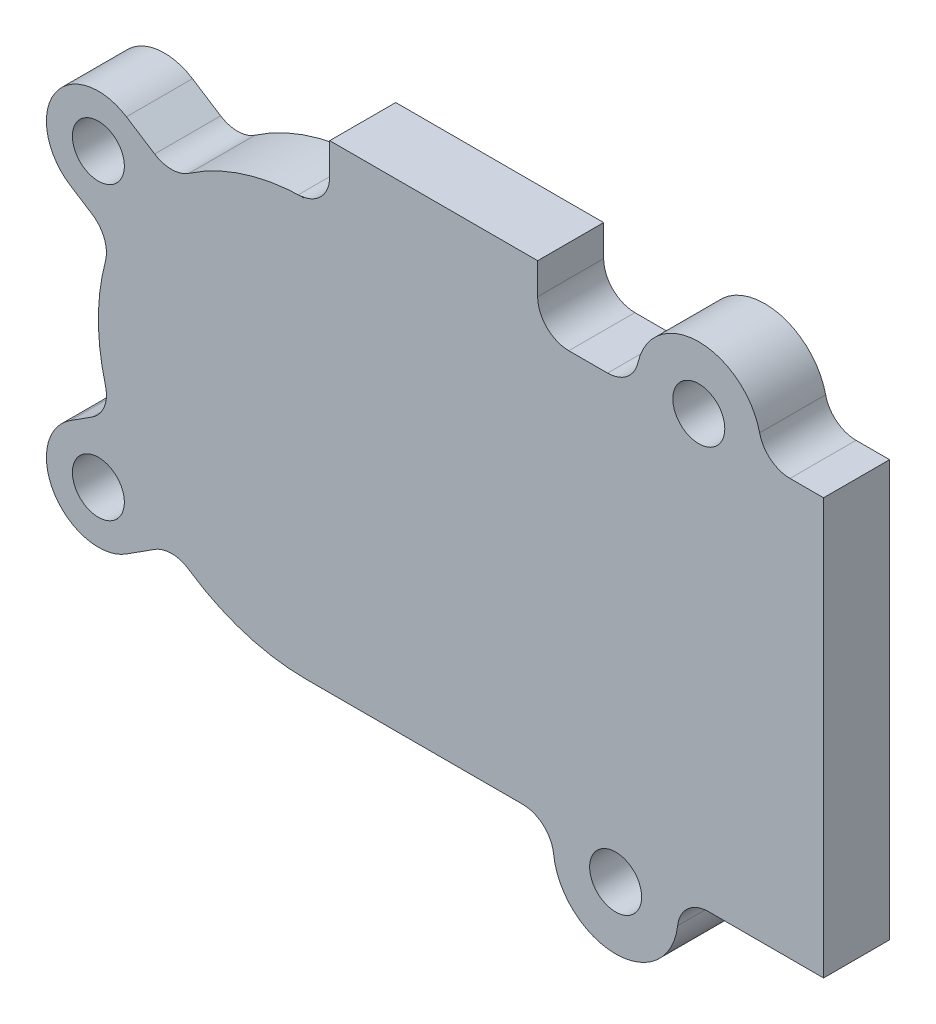
ISO-10303-21;
HEADER;
FILE_DESCRIPTION(('STEP AP214'),'2;1');
FILE_NAME('part.step','',(''),(''),'','','');
FILE_SCHEMA(('AUTOMOTIVE_DESIGN { 1 0 10303 214 1 1 1 1 }'));
ENDSEC;
DATA;
#1=APPLICATION_CONTEXT('core data for automotive mechanical design processes');
#2=APPLICATION_PROTOCOL_DEFINITION('international standard','automotive_design',2000,#1);
#3=PRODUCT_CONTEXT('',#1,'mechanical');
#4=PRODUCT('Part','Part','',(#3));
#5=PRODUCT_RELATED_PRODUCT_CATEGORY('part','',(#4));
#6=PRODUCT_DEFINITION_FORMATION('','',#4);
#7=PRODUCT_DEFINITION_CONTEXT('part definition',#1,'design');
#8=PRODUCT_DEFINITION('design','',#6,#7);
#9=PRODUCT_DEFINITION_SHAPE('','',#8);
#10=(LENGTH_UNIT() NAMED_UNIT(*) SI_UNIT(.MILLI.,.METRE.));
#11=(NAMED_UNIT(*) PLANE_ANGLE_UNIT() SI_UNIT($,.RADIAN.));
#12=(NAMED_UNIT(*) SI_UNIT($,.STERADIAN.) SOLID_ANGLE_UNIT());
#13=UNCERTAINTY_MEASURE_WITH_UNIT(LENGTH_MEASURE(1.E-05),#10,'distance_accuracy_value','');
#14=(GEOMETRIC_REPRESENTATION_CONTEXT(3) GLOBAL_UNCERTAINTY_ASSIGNED_CONTEXT((#13)) GLOBAL_UNIT_ASSIGNED_CONTEXT((#10,
#11,#12)) REPRESENTATION_CONTEXT('',''));
#15=CARTESIAN_POINT('',(0.,0.,0.));
#16=DIRECTION('',(0.,0.,1.));
#17=DIRECTION('',(1.,0.,0.));
#18=AXIS2_PLACEMENT_3D('',#15,#16,#17);
#19=CARTESIAN_POINT('',(17.5,-22.,6.35));
#20=DIRECTION('',(0.,0.,1.));
#21=DIRECTION('',(1.,0.,0.));
#22=AXIS2_PLACEMENT_3D('',#19,#20,#21);
#23=PLANE('',#22);
#24=CARTESIAN_POINT('',(-32.25,-14.,6.35));
#25=DIRECTION('',(0.,0.,1.));
#26=DIRECTION('',(1.,0.,0.));
#27=AXIS2_PLACEMENT_3D('',#24,#25,#26);
#28=CIRCLE('',#27,2.5);
#29=CARTESIAN_POINT('',(-29.75,-14.,6.35));
#30=VERTEX_POINT('',#29);
#31=EDGE_CURVE('E453',#30,#30,#28,.F.);
#32=ORIENTED_EDGE('',*,*,#31,.T.);
#33=EDGE_LOOP('',(#32));
#34=FACE_BOUND('',#33,.T.);
#35=DIRECTION('',(-0.841581546035128,-0.540130078197024,0.));
#36=VECTOR('',#35,1.);
#37=CARTESIAN_POINT('',(-0.344091690530346,0.536132366227416,6.35));
#38=LINE('',#37,#36);
#39=CARTESIAN_POINT('',(-26.8405061162537,-16.4693621852291,6.35));
#40=VERTEX_POINT('',#39);
#41=CARTESIAN_POINT('',(-29.5493496090149,-18.2079077301756,6.35));
#42=VERTEX_POINT('',#41);
#43=EDGE_CURVE('E408',#40,#42,#38,.T.);
#44=ORIENTED_EDGE('',*,*,#43,.F.);
#45=CARTESIAN_POINT('',(-25.2201158816627,-18.9941068233345,6.35));
#46=DIRECTION('',(0.,0.,1.));
#47=DIRECTION('',(1.,0.,0.));
#48=AXIS2_PLACEMENT_3D('',#45,#46,#47);
#49=CIRCLE('',#48,3.);
#50=CARTESIAN_POINT('',(-23.5283616362284,-16.5166146289865,6.35));
#51=VERTEX_POINT('',#50);
#52=EDGE_CURVE('E612',#40,#51,#49,.F.);
#53=ORIENTED_EDGE('',*,*,#52,.T.);
#54=CARTESIAN_POINT('',(-12.25,0.,6.35));
#55=DIRECTION('',(0.,0.,1.));
#56=DIRECTION('',(1.,0.,0.));
#57=AXIS2_PLACEMENT_3D('',#54,#55,#56);
#58=CIRCLE('',#57,20.);
#59=CARTESIAN_POINT('',(-12.25,-20.,6.35));
#60=VERTEX_POINT('',#59);
#61=EDGE_CURVE('E555',#51,#60,#58,.T.);
#62=ORIENTED_EDGE('',*,*,#61,.T.);
#63=DIRECTION('',(1.,0.,0.));
#64=VECTOR('',#63,1.);
#65=CARTESIAN_POINT('',(-37.5,-20.,6.35));
#66=LINE('',#65,#64);
#67=CARTESIAN_POINT('',(8.55572809000083,-20.,6.35));
#68=VERTEX_POINT('',#67);
#69=EDGE_CURVE('E498',#60,#68,#66,.T.);
#70=ORIENTED_EDGE('',*,*,#69,.T.);
#71=CARTESIAN_POINT('',(8.55572809000083,-23.,6.35));
#72=DIRECTION('',(0.,0.,1.));
#73=DIRECTION('',(1.,0.,0.));
#74=AXIS2_PLACEMENT_3D('',#71,#72,#73);
#75=CIRCLE('',#74,3.);
#76=CARTESIAN_POINT('',(11.5371520600005,-22.6666666666667,6.35));
#77=VERTEX_POINT('',#76);
#78=EDGE_CURVE('E629',#68,#77,#75,.F.);
#79=ORIENTED_EDGE('',*,*,#78,.T.);
#80=CARTESIAN_POINT('',(17.5,-22.,6.35));
#81=DIRECTION('',(0.,0.,1.));
#82=DIRECTION('',(1.,0.,0.));
#83=AXIS2_PLACEMENT_3D('',#80,#81,#82);
#84=CIRCLE('',#83,6.);
#85=CARTESIAN_POINT('',(23.4628479399994,-22.6666666666667,6.35));
#86=VERTEX_POINT('',#85);
#87=EDGE_CURVE('E501',#77,#86,#84,.T.);
#88=ORIENTED_EDGE('',*,*,#87,.T.);
#89=CARTESIAN_POINT('',(26.4442719099992,-23.,6.35));
#90=DIRECTION('',(0.,0.,1.));
#91=DIRECTION('',(1.,0.,0.));
#92=AXIS2_PLACEMENT_3D('',#89,#90,#91);
#93=CIRCLE('',#92,3.);
#94=CARTESIAN_POINT('',(26.4442719099992,-20.,6.35));
#95=VERTEX_POINT('',#94);
#96=EDGE_CURVE('E633',#86,#95,#93,.F.);
#97=ORIENTED_EDGE('',*,*,#96,.T.);
#98=DIRECTION('',(1.,0.,0.));
#99=VECTOR('',#98,1.);
#100=CARTESIAN_POINT('',(23.5,-20.,6.35));
#101=LINE('',#100,#99);
#102=CARTESIAN_POINT('',(37.5,-20.,6.35));
#103=VERTEX_POINT('',#102);
#104=EDGE_CURVE('E504',#95,#103,#101,.T.);
#105=ORIENTED_EDGE('',*,*,#104,.T.);
#106=DIRECTION('',(0.,1.,0.));
#107=VECTOR('',#106,1.);
#108=CARTESIAN_POINT('',(37.5,-20.,6.35));
#109=LINE('',#108,#107);
#110=CARTESIAN_POINT('',(37.5,20.,6.35));
#111=VERTEX_POINT('',#110);
#112=EDGE_CURVE('E506',#103,#111,#109,.T.);
#113=ORIENTED_EDGE('',*,*,#112,.T.);
#114=DIRECTION('',(-1.,0.,0.));
#115=VECTOR('',#114,1.);
#116=CARTESIAN_POINT('',(31.5,20.,6.35));
#117=LINE('',#116,#115);
#118=CARTESIAN_POINT('',(34.2749643873921,20.,6.35));
#119=VERTEX_POINT('',#118);
#120=EDGE_CURVE('E490',#111,#119,#117,.T.);
#121=ORIENTED_EDGE('',*,*,#120,.T.);
#122=CARTESIAN_POINT('',(34.2749643873921,23.,6.35));
#123=DIRECTION('',(0.,0.,1.));
#124=DIRECTION('',(1.,0.,0.));
#125=AXIS2_PLACEMENT_3D('',#122,#123,#124);
#126=CIRCLE('',#125,3.);
#127=CARTESIAN_POINT('',(31.3499762582614,22.3333333333333,6.35));
#128=VERTEX_POINT('',#127);
#129=EDGE_CURVE('E637',#119,#128,#126,.F.);
#130=ORIENTED_EDGE('',*,*,#129,.T.);
#131=CARTESIAN_POINT('',(25.5,21.,6.35));
#132=DIRECTION('',(0.,0.,1.));
#133=DIRECTION('',(1.,0.,0.));
#134=AXIS2_PLACEMENT_3D('',#131,#132,#133);
#135=CIRCLE('',#134,6.);
#136=CARTESIAN_POINT('',(19.6500237417386,22.3333333333333,6.35));
#137=VERTEX_POINT('',#136);
#138=EDGE_CURVE('E493',#128,#137,#135,.T.);
#139=ORIENTED_EDGE('',*,*,#138,.T.);
#140=CARTESIAN_POINT('',(16.7250356126079,23.,6.35));
#141=DIRECTION('',(0.,0.,1.));
#142=DIRECTION('',(1.,0.,0.));
#143=AXIS2_PLACEMENT_3D('',#140,#141,#142);
#144=CIRCLE('',#143,3.);
#145=CARTESIAN_POINT('',(16.7250356126079,20.,6.35));
#146=VERTEX_POINT('',#145);
#147=EDGE_CURVE('E12',#137,#146,#144,.F.);
#148=ORIENTED_EDGE('',*,*,#147,.T.);
#149=DIRECTION('',(-1.,0.,0.));
#150=VECTOR('',#149,1.);
#151=CARTESIAN_POINT('',(-37.5,20.,6.35));
#152=LINE('',#151,#150);
#153=CARTESIAN_POINT('',(13.,20.,6.35));
#154=VERTEX_POINT('',#153);
#155=EDGE_CURVE('E496',#146,#154,#152,.T.);
#156=ORIENTED_EDGE('',*,*,#155,.T.);
#157=CARTESIAN_POINT('',(13.,23.,6.35));
#158=DIRECTION('',(0.,0.,1.));
#159=DIRECTION('',(1.,0.,0.));
#160=AXIS2_PLACEMENT_3D('',#157,#158,#159);
#161=CIRCLE('',#160,3.);
#162=CARTESIAN_POINT('',(10.,23.,6.35));
#163=VERTEX_POINT('',#162);
#164=EDGE_CURVE('E546',#154,#163,#161,.F.);
#165=ORIENTED_EDGE('',*,*,#164,.T.);
#166=DIRECTION('',(0.,-1.,0.));
#167=VECTOR('',#166,1.);
#168=CARTESIAN_POINT('',(10.,26.,6.35));
#169=LINE('',#168,#167);
#170=CARTESIAN_POINT('',(10.,26.,6.35));
#171=VERTEX_POINT('',#170);
#172=EDGE_CURVE('E465',#171,#163,#169,.T.);
#173=ORIENTED_EDGE('',*,*,#172,.F.);
#174=DIRECTION('',(1.,0.,0.));
#175=VECTOR('',#174,1.);
#176=CARTESIAN_POINT('',(10.,26.,6.35));
#177=LINE('',#176,#175);
#178=CARTESIAN_POINT('',(-10.,26.,6.35));
#179=VERTEX_POINT('',#178);
#180=EDGE_CURVE('E463',#179,#171,#177,.T.);
#181=ORIENTED_EDGE('',*,*,#180,.F.);
#182=DIRECTION('',(0.,-1.,0.));
#183=VECTOR('',#182,1.);
#184=CARTESIAN_POINT('',(-10.,26.,6.35));
#185=LINE('',#184,#183);
#186=CARTESIAN_POINT('',(-10.,23.,6.35));
#187=VERTEX_POINT('',#186);
#188=EDGE_CURVE('E468',#179,#187,#185,.T.);
#189=ORIENTED_EDGE('',*,*,#188,.T.);
#190=CARTESIAN_POINT('',(-13.,23.,6.35));
#191=DIRECTION('',(0.,0.,1.));
#192=DIRECTION('',(1.,0.,0.));
#193=AXIS2_PLACEMENT_3D('',#190,#191,#192);
#194=CIRCLE('',#193,3.);
#195=CARTESIAN_POINT('',(-13.,20.,6.35));
#196=VERTEX_POINT('',#195);
#197=EDGE_CURVE('E540',#187,#196,#194,.F.);
#198=ORIENTED_EDGE('',*,*,#197,.T.);
#199=DIRECTION('',(1.,0.,0.));
#200=VECTOR('',#199,1.);
#201=CARTESIAN_POINT('',(0.,20.,6.35));
#202=LINE('',#201,#200);
#203=CARTESIAN_POINT('',(-12.25,20.,6.35));
#204=VERTEX_POINT('',#203);
#205=EDGE_CURVE('E438',#204,#196,#202,.F.);
#206=ORIENTED_EDGE('',*,*,#205,.F.);
#207=CARTESIAN_POINT('',(-12.25,0.,6.35));
#208=DIRECTION('',(0.,0.,1.));
#209=DIRECTION('',(1.,0.,0.));
#210=AXIS2_PLACEMENT_3D('',#207,#208,#209);
#211=CIRCLE('',#210,20.);
#212=CARTESIAN_POINT('',(-23.5283616362284,16.5166146289865,6.35));
#213=VERTEX_POINT('',#212);
#214=EDGE_CURVE('E569',#204,#213,#211,.T.);
#215=ORIENTED_EDGE('',*,*,#214,.T.);
#216=CARTESIAN_POINT('',(-25.2201158816627,18.9941068233345,6.35));
#217=DIRECTION('',(0.,0.,1.));
#218=DIRECTION('',(1.,0.,0.));
#219=AXIS2_PLACEMENT_3D('',#216,#217,#218);
#220=CIRCLE('',#219,3.);
#221=CARTESIAN_POINT('',(-26.8405061162537,16.4693621852291,6.35));
#222=VERTEX_POINT('',#221);
#223=EDGE_CURVE('E615',#213,#222,#220,.F.);
#224=ORIENTED_EDGE('',*,*,#223,.T.);
#225=DIRECTION('',(-0.841581546035129,0.540130078197024,0.));
#226=VECTOR('',#225,1.);
#227=CARTESIAN_POINT('',(-25.0820279931602,15.3407645696932,6.35));
#228=LINE('',#227,#226);
#229=CARTESIAN_POINT('',(-29.5493496090149,18.2079077301756,6.35));
#230=VERTEX_POINT('',#229);
#231=EDGE_CURVE('E567',#222,#230,#228,.T.);
#232=ORIENTED_EDGE('',*,*,#231,.T.);
#233=CARTESIAN_POINT('',(-32.25,14.,6.35));
#234=DIRECTION('',(0.,0.,1.));
#235=DIRECTION('',(1.,0.,0.));
#236=AXIS2_PLACEMENT_3D('',#233,#234,#235);
#237=CIRCLE('',#236,5.);
#238=CARTESIAN_POINT('',(-34.9506503909851,9.79209226982436,6.35));
#239=VERTEX_POINT('',#238);
#240=EDGE_CURVE('E564',#230,#239,#237,.T.);
#241=ORIENTED_EDGE('',*,*,#240,.T.);
#242=DIRECTION('',(0.841581546035128,-0.540130078197024,0.));
#243=VECTOR('',#242,1.);
#244=CARTESIAN_POINT('',(-34.9506503909851,9.79209226982438,6.35));
#245=LINE('',#244,#243);
#246=CARTESIAN_POINT('',(-32.8541888823333,8.44657569577404,6.35));
#247=VERTEX_POINT('',#246);
#248=EDGE_CURVE('E561',#239,#247,#245,.T.);
#249=ORIENTED_EDGE('',*,*,#248,.T.);
#250=CARTESIAN_POINT('',(-34.4745791169244,5.92183105766866,6.35));
#251=DIRECTION('',(0.,0.,1.));
#252=DIRECTION('',(1.,0.,0.));
#253=AXIS2_PLACEMENT_3D('',#250,#251,#252);
#254=CIRCLE('',#253,3.);
#255=CARTESIAN_POINT('',(-31.5757209712386,5.14941831101623,6.35));
#256=VERTEX_POINT('',#255);
#257=EDGE_CURVE('E623',#247,#256,#254,.F.);
#258=ORIENTED_EDGE('',*,*,#257,.T.);
#259=CARTESIAN_POINT('',(-12.25,0.,6.35));
#260=DIRECTION('',(0.,0.,1.));
#261=DIRECTION('',(1.,0.,0.));
#262=AXIS2_PLACEMENT_3D('',#259,#260,#261);
#263=CIRCLE('',#262,20.);
#264=CARTESIAN_POINT('',(-31.5757209712386,-5.14941831101623,6.35));
#265=VERTEX_POINT('',#264);
#266=EDGE_CURVE('E558',#256,#265,#263,.T.);
#267=ORIENTED_EDGE('',*,*,#266,.T.);
#268=CARTESIAN_POINT('',(-34.4745791169244,-5.92183105766866,6.35));
#269=DIRECTION('',(0.,0.,1.));
#270=DIRECTION('',(1.,0.,0.));
#271=AXIS2_PLACEMENT_3D('',#268,#269,#270);
#272=CIRCLE('',#271,3.);
#273=CARTESIAN_POINT('',(-32.8541888823333,-8.44657569577404,6.35));
#274=VERTEX_POINT('',#273);
#275=EDGE_CURVE('E619',#265,#274,#272,.F.);
#276=ORIENTED_EDGE('',*,*,#275,.T.);
#277=DIRECTION('',(0.841581546035128,0.540130078197025,0.));
#278=VECTOR('',#277,1.);
#279=CARTESIAN_POINT('',(-5.7453924725006,8.95194782657871,6.35));
#280=LINE('',#279,#278);
#281=CARTESIAN_POINT('',(-34.9506503909851,-9.79209226982437,6.35));
#282=VERTEX_POINT('',#281);
#283=EDGE_CURVE('E554',#282,#274,#280,.T.);
#284=ORIENTED_EDGE('',*,*,#283,.F.);
#285=CARTESIAN_POINT('',(-32.25,-14.,6.35));
#286=DIRECTION('',(0.,0.,1.));
#287=DIRECTION('',(1.,0.,0.));
#288=AXIS2_PLACEMENT_3D('',#285,#286,#287);
#289=CIRCLE('',#288,5.);
#290=EDGE_CURVE('E552',#42,#282,#289,.F.);
#291=ORIENTED_EDGE('',*,*,#290,.F.);
#292=EDGE_LOOP('',(#44,#53,#62,#70,#79,#88,#97,#105,#113,#121,#130,#139,#148,#156,#165,#173,
#181,#189,#198,#206,#215,#224,#232,#241,#249,#258,#267,#276,#284,#291));
#293=FACE_BOUND('',#292,.T.);
#294=CARTESIAN_POINT('',(25.5,21.,6.35));
#295=DIRECTION('',(0.,0.,1.));
#296=DIRECTION('',(1.,0.,0.));
#297=AXIS2_PLACEMENT_3D('',#294,#295,#296);
#298=CIRCLE('',#297,2.5);
#299=CARTESIAN_POINT('',(28.,21.,6.35));
#300=VERTEX_POINT('',#299);
#301=EDGE_CURVE('E484',#300,#300,#298,.T.);
#302=ORIENTED_EDGE('',*,*,#301,.F.);
#303=EDGE_LOOP('',(#302));
#304=FACE_BOUND('',#303,.T.);
#305=CARTESIAN_POINT('',(17.5,-22.,6.35));
#306=DIRECTION('',(0.,0.,1.));
#307=DIRECTION('',(1.,0.,0.));
#308=AXIS2_PLACEMENT_3D('',#305,#306,#307);
#309=CIRCLE('',#308,2.5);
#310=CARTESIAN_POINT('',(20.,-22.,6.35));
#311=VERTEX_POINT('',#310);
#312=EDGE_CURVE('E478',#311,#311,#309,.T.);
#313=ORIENTED_EDGE('',*,*,#312,.F.);
#314=EDGE_LOOP('',(#313));
#315=FACE_BOUND('',#314,.T.);
#316=CARTESIAN_POINT('',(-32.25,14.,6.35));
#317=DIRECTION('',(0.,0.,1.));
#318=DIRECTION('',(1.,0.,0.));
#319=AXIS2_PLACEMENT_3D('',#316,#317,#318);
#320=CIRCLE('',#319,2.5);
#321=CARTESIAN_POINT('',(-29.75,14.,6.35));
#322=VERTEX_POINT('',#321);
#323=EDGE_CURVE('E450',#322,#322,#320,.T.);
#324=ORIENTED_EDGE('',*,*,#323,.F.);
#325=EDGE_LOOP('',(#324));
#326=FACE_BOUND('',#325,.T.);
#327=ADVANCED_FACE('F193',(#34,#293,#304,#315,#326),#23,.T.);
#328=CARTESIAN_POINT('',(17.5,-22.,0.));
#329=DIRECTION('',(0.,0.,1.));
#330=DIRECTION('',(1.,0.,0.));
#331=AXIS2_PLACEMENT_3D('',#328,#329,#330);
#332=PLANE('',#331);
#333=CARTESIAN_POINT('',(-32.25,-14.,0.));
#334=DIRECTION('',(0.,0.,1.));
#335=DIRECTION('',(1.,0.,0.));
#336=AXIS2_PLACEMENT_3D('',#333,#334,#335);
#337=CIRCLE('',#336,2.5);
#338=CARTESIAN_POINT('',(-29.75,-14.,0.));
#339=VERTEX_POINT('',#338);
#340=EDGE_CURVE('E1046',#339,#339,#337,.F.);
#341=ORIENTED_EDGE('',*,*,#340,.F.);
#342=EDGE_LOOP('',(#341));
#343=FACE_BOUND('',#342,.T.);
#344=CARTESIAN_POINT('',(17.5,-22.,0.));
#345=DIRECTION('',(0.,0.,1.));
#346=DIRECTION('',(1.,0.,0.));
#347=AXIS2_PLACEMENT_3D('',#344,#345,#346);
#348=CIRCLE('',#347,2.5);
#349=CARTESIAN_POINT('',(20.,-22.,0.));
#350=VERTEX_POINT('',#349);
#351=EDGE_CURVE('E477',#350,#350,#348,.T.);
#352=ORIENTED_EDGE('',*,*,#351,.T.);
#353=EDGE_LOOP('',(#352));
#354=FACE_BOUND('',#353,.T.);
#355=CARTESIAN_POINT('',(25.5,21.,0.));
#356=DIRECTION('',(0.,0.,1.));
#357=DIRECTION('',(1.,0.,0.));
#358=AXIS2_PLACEMENT_3D('',#355,#356,#357);
#359=CIRCLE('',#358,2.5);
#360=CARTESIAN_POINT('',(28.,21.,0.));
#361=VERTEX_POINT('',#360);
#362=EDGE_CURVE('E481',#361,#361,#359,.T.);
#363=ORIENTED_EDGE('',*,*,#362,.T.);
#364=EDGE_LOOP('',(#363));
#365=FACE_BOUND('',#364,.T.);
#366=CARTESIAN_POINT('',(-12.25,0.,0.));
#367=DIRECTION('',(0.,0.,1.));
#368=DIRECTION('',(1.,0.,0.));
#369=AXIS2_PLACEMENT_3D('',#366,#367,#368);
#370=CIRCLE('',#369,20.);
#371=CARTESIAN_POINT('',(-23.5283616362284,-16.5166146289865,0.));
#372=VERTEX_POINT('',#371);
#373=CARTESIAN_POINT('',(-12.25,-20.,0.));
#374=VERTEX_POINT('',#373);
#375=EDGE_CURVE('E412',#372,#374,#370,.T.);
#376=ORIENTED_EDGE('',*,*,#375,.F.);
#377=CARTESIAN_POINT('',(-25.2201158816627,-18.9941068233345,0.));
#378=DIRECTION('',(0.,0.,1.));
#379=DIRECTION('',(1.,0.,0.));
#380=AXIS2_PLACEMENT_3D('',#377,#378,#379);
#381=CIRCLE('',#380,3.);
#382=CARTESIAN_POINT('',(-26.8405061162537,-16.4693621852291,0.));
#383=VERTEX_POINT('',#382);
#384=EDGE_CURVE('E398',#372,#383,#381,.T.);
#385=ORIENTED_EDGE('',*,*,#384,.T.);
#386=DIRECTION('',(-0.841581546035128,-0.540130078197024,0.));
#387=VECTOR('',#386,1.);
#388=CARTESIAN_POINT('',(-0.344091690530346,0.536132366227416,0.));
#389=LINE('',#388,#387);
#390=CARTESIAN_POINT('',(-29.5493496090149,-18.2079077301756,0.));
#391=VERTEX_POINT('',#390);
#392=EDGE_CURVE('E389',#383,#391,#389,.T.);
#393=ORIENTED_EDGE('',*,*,#392,.T.);
#394=CARTESIAN_POINT('',(-32.25,-14.,0.));
#395=DIRECTION('',(0.,0.,1.));
#396=DIRECTION('',(1.,0.,0.));
#397=AXIS2_PLACEMENT_3D('',#394,#395,#396);
#398=CIRCLE('',#397,5.);
#399=CARTESIAN_POINT('',(-34.9506503909851,-9.79209226982437,0.));
#400=VERTEX_POINT('',#399);
#401=EDGE_CURVE('E396',#391,#400,#398,.F.);
#402=ORIENTED_EDGE('',*,*,#401,.T.);
#403=DIRECTION('',(0.841581546035128,0.540130078197025,0.));
#404=VECTOR('',#403,1.);
#405=CARTESIAN_POINT('',(-5.7453924725006,8.95194782657871,0.));
#406=LINE('',#405,#404);
#407=CARTESIAN_POINT('',(-32.8541888823333,-8.44657569577404,0.));
#408=VERTEX_POINT('',#407);
#409=EDGE_CURVE('E417',#400,#408,#406,.T.);
#410=ORIENTED_EDGE('',*,*,#409,.T.);
#411=CARTESIAN_POINT('',(-34.4745791169244,-5.92183105766866,0.));
#412=DIRECTION('',(0.,0.,1.));
#413=DIRECTION('',(1.,0.,0.));
#414=AXIS2_PLACEMENT_3D('',#411,#412,#413);
#415=CIRCLE('',#414,3.);
#416=CARTESIAN_POINT('',(-31.5757209712386,-5.14941831101623,0.));
#417=VERTEX_POINT('',#416);
#418=EDGE_CURVE('E621',#408,#417,#415,.T.);
#419=ORIENTED_EDGE('',*,*,#418,.T.);
#420=CARTESIAN_POINT('',(-31.5757209712386,5.14941831101623,0.));
#421=VERTEX_POINT('',#420);
#422=EDGE_CURVE('E419',#421,#417,#370,.T.);
#423=ORIENTED_EDGE('',*,*,#422,.F.);
#424=CARTESIAN_POINT('',(-34.4745791169244,5.92183105766866,0.));
#425=DIRECTION('',(0.,0.,1.));
#426=DIRECTION('',(1.,0.,0.));
#427=AXIS2_PLACEMENT_3D('',#424,#425,#426);
#428=CIRCLE('',#427,3.);
#429=CARTESIAN_POINT('',(-32.8541888823333,8.44657569577404,0.));
#430=VERTEX_POINT('',#429);
#431=EDGE_CURVE('E625',#421,#430,#428,.T.);
#432=ORIENTED_EDGE('',*,*,#431,.T.);
#433=DIRECTION('',(0.841581546035128,-0.540130078197025,0.));
#434=VECTOR('',#433,1.);
#435=CARTESIAN_POINT('',(-5.7453924725006,-8.95194782657871,0.));
#436=LINE('',#435,#434);
#437=CARTESIAN_POINT('',(-34.9506503909851,9.79209226982437,0.));
#438=VERTEX_POINT('',#437);
#439=EDGE_CURVE('E425',#438,#430,#436,.T.);
#440=ORIENTED_EDGE('',*,*,#439,.F.);
#441=CARTESIAN_POINT('',(-32.25,14.,0.));
#442=DIRECTION('',(0.,0.,1.));
#443=DIRECTION('',(1.,0.,0.));
#444=AXIS2_PLACEMENT_3D('',#441,#442,#443);
#445=CIRCLE('',#444,5.);
#446=CARTESIAN_POINT('',(-29.5493496090149,18.2079077301756,0.));
#447=VERTEX_POINT('',#446);
#448=EDGE_CURVE('E429',#447,#438,#445,.T.);
#449=ORIENTED_EDGE('',*,*,#448,.F.);
#450=DIRECTION('',(-0.841581546035128,0.540130078197024,0.));
#451=VECTOR('',#450,1.);
#452=CARTESIAN_POINT('',(-0.344091690530346,-0.536132366227416,0.));
#453=LINE('',#452,#451);
#454=CARTESIAN_POINT('',(-26.8405061162537,16.4693621852291,0.));
#455=VERTEX_POINT('',#454);
#456=EDGE_CURVE('E431',#455,#447,#453,.T.);
#457=ORIENTED_EDGE('',*,*,#456,.F.);
#458=CARTESIAN_POINT('',(-25.2201158816627,18.9941068233345,0.));
#459=DIRECTION('',(0.,0.,1.));
#460=DIRECTION('',(1.,0.,0.));
#461=AXIS2_PLACEMENT_3D('',#458,#459,#460);
#462=CIRCLE('',#461,3.);
#463=CARTESIAN_POINT('',(-23.5283616362284,16.5166146289865,0.));
#464=VERTEX_POINT('',#463);
#465=EDGE_CURVE('E617',#455,#464,#462,.T.);
#466=ORIENTED_EDGE('',*,*,#465,.T.);
#467=CARTESIAN_POINT('',(-12.25,20.,0.));
#468=VERTEX_POINT('',#467);
#469=EDGE_CURVE('E426',#468,#464,#370,.T.);
#470=ORIENTED_EDGE('',*,*,#469,.F.);
#471=DIRECTION('',(-1.,0.,0.));
#472=VECTOR('',#471,1.);
#473=CARTESIAN_POINT('',(0.,20.,0.));
#474=LINE('',#473,#472);
#475=CARTESIAN_POINT('',(-13.,20.,0.));
#476=VERTEX_POINT('',#475);
#477=EDGE_CURVE('E433',#468,#476,#474,.T.);
#478=ORIENTED_EDGE('',*,*,#477,.T.);
#479=CARTESIAN_POINT('',(-13.,23.,0.));
#480=DIRECTION('',(0.,0.,1.));
#481=DIRECTION('',(1.,0.,0.));
#482=AXIS2_PLACEMENT_3D('',#479,#480,#481);
#483=CIRCLE('',#482,3.);
#484=CARTESIAN_POINT('',(-10.,23.,0.));
#485=VERTEX_POINT('',#484);
#486=EDGE_CURVE('E541',#476,#485,#483,.T.);
#487=ORIENTED_EDGE('',*,*,#486,.T.);
#488=DIRECTION('',(0.,-1.,0.));
#489=VECTOR('',#488,1.);
#490=CARTESIAN_POINT('',(-10.,26.,0.));
#491=LINE('',#490,#489);
#492=CARTESIAN_POINT('',(-10.,26.,0.));
#493=VERTEX_POINT('',#492);
#494=EDGE_CURVE('E471',#493,#485,#491,.T.);
#495=ORIENTED_EDGE('',*,*,#494,.F.);
#496=DIRECTION('',(-1.,0.,0.));
#497=VECTOR('',#496,1.);
#498=CARTESIAN_POINT('',(10.,26.,0.));
#499=LINE('',#498,#497);
#500=CARTESIAN_POINT('',(10.,26.,0.));
#501=VERTEX_POINT('',#500);
#502=EDGE_CURVE('E459',#501,#493,#499,.T.);
#503=ORIENTED_EDGE('',*,*,#502,.F.);
#504=DIRECTION('',(0.,-1.,0.));
#505=VECTOR('',#504,1.);
#506=CARTESIAN_POINT('',(10.,26.,0.));
#507=LINE('',#506,#505);
#508=CARTESIAN_POINT('',(10.,23.,0.));
#509=VERTEX_POINT('',#508);
#510=EDGE_CURVE('E474',#501,#509,#507,.T.);
#511=ORIENTED_EDGE('',*,*,#510,.T.);
#512=CARTESIAN_POINT('',(13.,23.,0.));
#513=DIRECTION('',(0.,0.,1.));
#514=DIRECTION('',(1.,0.,0.));
#515=AXIS2_PLACEMENT_3D('',#512,#513,#514);
#516=CIRCLE('',#515,3.);
#517=CARTESIAN_POINT('',(13.,20.,0.));
#518=VERTEX_POINT('',#517);
#519=EDGE_CURVE('E543',#509,#518,#516,.T.);
#520=ORIENTED_EDGE('',*,*,#519,.T.);
#521=DIRECTION('',(-1.,0.,0.));
#522=VECTOR('',#521,1.);
#523=CARTESIAN_POINT('',(-37.5,20.,0.));
#524=LINE('',#523,#522);
#525=CARTESIAN_POINT('',(16.7250356126079,20.,0.));
#526=VERTEX_POINT('',#525);
#527=EDGE_CURVE('E514',#526,#518,#524,.T.);
#528=ORIENTED_EDGE('',*,*,#527,.F.);
#529=CARTESIAN_POINT('',(16.7250356126079,23.,0.));
#530=DIRECTION('',(0.,0.,1.));
#531=DIRECTION('',(1.,0.,0.));
#532=AXIS2_PLACEMENT_3D('',#529,#530,#531);
#533=CIRCLE('',#532,3.);
#534=CARTESIAN_POINT('',(19.6500237417386,22.3333333333333,0.));
#535=VERTEX_POINT('',#534);
#536=EDGE_CURVE('E201',#526,#535,#533,.T.);
#537=ORIENTED_EDGE('',*,*,#536,.T.);
#538=CARTESIAN_POINT('',(25.5,21.,0.));
#539=DIRECTION('',(0.,0.,1.));
#540=DIRECTION('',(1.,0.,0.));
#541=AXIS2_PLACEMENT_3D('',#538,#539,#540);
#542=CIRCLE('',#541,6.);
#543=CARTESIAN_POINT('',(31.3499762582614,22.3333333333333,0.));
#544=VERTEX_POINT('',#543);
#545=EDGE_CURVE('E511',#544,#535,#542,.T.);
#546=ORIENTED_EDGE('',*,*,#545,.F.);
#547=CARTESIAN_POINT('',(34.2749643873921,23.,0.));
#548=DIRECTION('',(0.,0.,1.));
#549=DIRECTION('',(1.,0.,0.));
#550=AXIS2_PLACEMENT_3D('',#547,#548,#549);
#551=CIRCLE('',#550,3.);
#552=CARTESIAN_POINT('',(34.2749643873921,20.,0.));
#553=VERTEX_POINT('',#552);
#554=EDGE_CURVE('E635',#544,#553,#551,.T.);
#555=ORIENTED_EDGE('',*,*,#554,.T.);
#556=DIRECTION('',(-1.,0.,0.));
#557=VECTOR('',#556,1.);
#558=CARTESIAN_POINT('',(31.5,20.,0.));
#559=LINE('',#558,#557);
#560=CARTESIAN_POINT('',(37.5,20.,0.));
#561=VERTEX_POINT('',#560);
#562=EDGE_CURVE('E487',#561,#553,#559,.T.);
#563=ORIENTED_EDGE('',*,*,#562,.F.);
#564=DIRECTION('',(0.,1.,0.));
#565=VECTOR('',#564,1.);
#566=CARTESIAN_POINT('',(37.5,-20.,0.));
#567=LINE('',#566,#565);
#568=CARTESIAN_POINT('',(37.5,-20.,0.));
#569=VERTEX_POINT('',#568);
#570=EDGE_CURVE('E494',#569,#561,#567,.T.);
#571=ORIENTED_EDGE('',*,*,#570,.F.);
#572=DIRECTION('',(1.,0.,0.));
#573=VECTOR('',#572,1.);
#574=CARTESIAN_POINT('',(23.5,-20.,0.));
#575=LINE('',#574,#573);
#576=CARTESIAN_POINT('',(26.4442719099992,-20.,0.));
#577=VERTEX_POINT('',#576);
#578=EDGE_CURVE('E522',#577,#569,#575,.T.);
#579=ORIENTED_EDGE('',*,*,#578,.F.);
#580=CARTESIAN_POINT('',(26.4442719099992,-23.,0.));
#581=DIRECTION('',(0.,0.,1.));
#582=DIRECTION('',(1.,0.,0.));
#583=AXIS2_PLACEMENT_3D('',#580,#581,#582);
#584=CIRCLE('',#583,3.);
#585=CARTESIAN_POINT('',(23.4628479399994,-22.6666666666667,0.));
#586=VERTEX_POINT('',#585);
#587=EDGE_CURVE('E631',#577,#586,#584,.T.);
#588=ORIENTED_EDGE('',*,*,#587,.T.);
#589=CARTESIAN_POINT('',(17.5,-22.,0.));
#590=DIRECTION('',(0.,0.,1.));
#591=DIRECTION('',(1.,0.,0.));
#592=AXIS2_PLACEMENT_3D('',#589,#590,#591);
#593=CIRCLE('',#592,6.);
#594=CARTESIAN_POINT('',(11.5371520600005,-22.6666666666667,0.));
#595=VERTEX_POINT('',#594);
#596=EDGE_CURVE('E519',#595,#586,#593,.T.);
#597=ORIENTED_EDGE('',*,*,#596,.F.);
#598=CARTESIAN_POINT('',(8.55572809000083,-23.,0.));
#599=DIRECTION('',(0.,0.,1.));
#600=DIRECTION('',(1.,0.,0.));
#601=AXIS2_PLACEMENT_3D('',#598,#599,#600);
#602=CIRCLE('',#601,3.);
#603=CARTESIAN_POINT('',(8.55572809000083,-20.,0.));
#604=VERTEX_POINT('',#603);
#605=EDGE_CURVE('E627',#595,#604,#602,.T.);
#606=ORIENTED_EDGE('',*,*,#605,.T.);
#607=DIRECTION('',(1.,0.,0.));
#608=VECTOR('',#607,1.);
#609=CARTESIAN_POINT('',(-37.5,-20.,0.));
#610=LINE('',#609,#608);
#611=EDGE_CURVE('E516',#374,#604,#610,.T.);
#612=ORIENTED_EDGE('',*,*,#611,.F.);
#613=EDGE_LOOP('',(#376,#385,#393,#402,#410,#419,#423,#432,#440,#449,#457,#466,#470,#478,#487,
#495,#503,#511,#520,#528,#537,#546,#555,#563,#571,#579,#588,#597,#606,#612));
#614=FACE_BOUND('',#613,.T.);
#615=CARTESIAN_POINT('',(-32.25,14.,0.));
#616=DIRECTION('',(0.,0.,1.));
#617=DIRECTION('',(1.,0.,0.));
#618=AXIS2_PLACEMENT_3D('',#615,#616,#617);
#619=CIRCLE('',#618,2.5);
#620=CARTESIAN_POINT('',(-29.75,14.,0.));
#621=VERTEX_POINT('',#620);
#622=EDGE_CURVE('E402',#621,#621,#619,.T.);
#623=ORIENTED_EDGE('',*,*,#622,.T.);
#624=EDGE_LOOP('',(#623));
#625=FACE_BOUND('',#624,.T.);
#626=ADVANCED_FACE('F392',(#343,#354,#365,#614,#625),#332,.F.);
#627=CARTESIAN_POINT('',(-37.5,-20.,6.35));
#628=DIRECTION('',(0.,1.,0.));
#629=DIRECTION('',(0.,0.,1.));
#630=AXIS2_PLACEMENT_3D('',#627,#628,#629);
#631=PLANE('',#630);
#632=ORIENTED_EDGE('',*,*,#611,.T.);
#633=DIRECTION('',(0.,0.,1.));
#634=VECTOR('',#633,1.);
#635=CARTESIAN_POINT('',(8.55572809000083,-20.,6.35));
#636=LINE('',#635,#634);
#637=EDGE_CURVE('E598',#604,#68,#636,.T.);
#638=ORIENTED_EDGE('',*,*,#637,.T.);
#639=ORIENTED_EDGE('',*,*,#69,.F.);
#640=DIRECTION('',(0.,0.,1.));
#641=VECTOR('',#640,1.);
#642=CARTESIAN_POINT('',(-12.25,-20.,0.));
#643=LINE('',#642,#641);
#644=EDGE_CURVE('E436',#374,#60,#643,.T.);
#645=ORIENTED_EDGE('',*,*,#644,.F.);
#646=EDGE_LOOP('',(#632,#638,#639,#645));
#647=FACE_BOUND('',#646,.T.);
#648=ADVANCED_FACE('F688',(#647),#631,.F.);
#649=CARTESIAN_POINT('',(-37.5,20.,6.35));
#650=DIRECTION('',(0.,-1.,0.));
#651=DIRECTION('',(0.,0.,-1.));
#652=AXIS2_PLACEMENT_3D('',#649,#650,#651);
#653=PLANE('',#652);
#654=ORIENTED_EDGE('',*,*,#155,.F.);
#655=DIRECTION('',(0.,0.,1.));
#656=VECTOR('',#655,1.);
#657=CARTESIAN_POINT('',(16.7250356126079,20.,0.));
#658=LINE('',#657,#656);
#659=EDGE_CURVE('E610',#146,#526,#658,.F.);
#660=ORIENTED_EDGE('',*,*,#659,.T.);
#661=ORIENTED_EDGE('',*,*,#527,.T.);
#662=DIRECTION('',(0.,0.,-1.));
#663=VECTOR('',#662,1.);
#664=CARTESIAN_POINT('',(13.,20.,6.35));
#665=LINE('',#664,#663);
#666=EDGE_CURVE('E537',#518,#154,#665,.F.);
#667=ORIENTED_EDGE('',*,*,#666,.T.);
#668=EDGE_LOOP('',(#654,#660,#661,#667));
#669=FACE_BOUND('',#668,.T.);
#670=ADVANCED_FACE('F645',(#669),#653,.F.);
#671=CARTESIAN_POINT('',(31.5,20.,6.35));
#672=DIRECTION('',(0.,-1.,0.));
#673=DIRECTION('',(0.,0.,-1.));
#674=AXIS2_PLACEMENT_3D('',#671,#672,#673);
#675=PLANE('',#674);
#676=ORIENTED_EDGE('',*,*,#562,.T.);
#677=DIRECTION('',(0.,0.,1.));
#678=VECTOR('',#677,1.);
#679=CARTESIAN_POINT('',(34.2749643873921,20.,6.35));
#680=LINE('',#679,#678);
#681=EDGE_CURVE('E608',#553,#119,#680,.T.);
#682=ORIENTED_EDGE('',*,*,#681,.T.);
#683=ORIENTED_EDGE('',*,*,#120,.F.);
#684=DIRECTION('',(0.,0.,-1.));
#685=VECTOR('',#684,1.);
#686=CARTESIAN_POINT('',(37.5,20.,6.35));
#687=LINE('',#686,#685);
#688=EDGE_CURVE('E508',#111,#561,#687,.T.);
#689=ORIENTED_EDGE('',*,*,#688,.T.);
#690=EDGE_LOOP('',(#676,#682,#683,#689));
#691=FACE_BOUND('',#690,.T.);
#692=ADVANCED_FACE('F716',(#691),#675,.F.);
#693=CARTESIAN_POINT('',(25.5,21.,6.35));
#694=DIRECTION('',(0.,0.,-1.));
#695=DIRECTION('',(-1.,0.,0.));
#696=AXIS2_PLACEMENT_3D('',#693,#694,#695);
#697=CYLINDRICAL_SURFACE('',#696,6.);
#698=ORIENTED_EDGE('',*,*,#138,.F.);
#699=DIRECTION('',(0.,0.,-1.));
#700=VECTOR('',#699,1.);
#701=CARTESIAN_POINT('',(31.3499762582614,22.3333333333333,6.35));
#702=LINE('',#701,#700);
#703=EDGE_CURVE('E605',#128,#544,#702,.T.);
#704=ORIENTED_EDGE('',*,*,#703,.T.);
#705=ORIENTED_EDGE('',*,*,#545,.T.);
#706=DIRECTION('',(0.,0.,-1.));
#707=VECTOR('',#706,1.);
#708=CARTESIAN_POINT('',(19.6500237417386,22.3333333333333,6.35));
#709=LINE('',#708,#707);
#710=EDGE_CURVE('E603',#535,#137,#709,.F.);
#711=ORIENTED_EDGE('',*,*,#710,.T.);
#712=EDGE_LOOP('',(#698,#704,#705,#711));
#713=FACE_BOUND('',#712,.T.);
#714=ADVANCED_FACE('F642',(#713),#697,.T.);
#715=CARTESIAN_POINT('',(17.5,-22.,6.35));
#716=DIRECTION('',(0.,0.,-1.));
#717=DIRECTION('',(-1.,0.,0.));
#718=AXIS2_PLACEMENT_3D('',#715,#716,#717);
#719=CYLINDRICAL_SURFACE('',#718,6.);
#720=ORIENTED_EDGE('',*,*,#87,.F.);
#721=DIRECTION('',(0.,0.,-1.));
#722=VECTOR('',#721,1.);
#723=CARTESIAN_POINT('',(11.5371520600005,-22.6666666666667,6.35));
#724=LINE('',#723,#722);
#725=EDGE_CURVE('E595',#77,#595,#724,.T.);
#726=ORIENTED_EDGE('',*,*,#725,.T.);
#727=ORIENTED_EDGE('',*,*,#596,.T.);
#728=DIRECTION('',(0.,0.,-1.));
#729=VECTOR('',#728,1.);
#730=CARTESIAN_POINT('',(23.4628479399994,-22.6666666666667,6.35));
#731=LINE('',#730,#729);
#732=EDGE_CURVE('E593',#586,#86,#731,.F.);
#733=ORIENTED_EDGE('',*,*,#732,.T.);
#734=EDGE_LOOP('',(#720,#726,#727,#733));
#735=FACE_BOUND('',#734,.T.);
#736=ADVANCED_FACE('F697',(#735),#719,.T.);
#737=CARTESIAN_POINT('',(23.5,-20.,6.35));
#738=DIRECTION('',(0.,1.,0.));
#739=DIRECTION('',(0.,0.,1.));
#740=AXIS2_PLACEMENT_3D('',#737,#738,#739);
#741=PLANE('',#740);
#742=ORIENTED_EDGE('',*,*,#104,.F.);
#743=DIRECTION('',(0.,0.,1.));
#744=VECTOR('',#743,1.);
#745=CARTESIAN_POINT('',(26.4442719099992,-20.,0.));
#746=LINE('',#745,#744);
#747=EDGE_CURVE('E600',#95,#577,#746,.F.);
#748=ORIENTED_EDGE('',*,*,#747,.T.);
#749=ORIENTED_EDGE('',*,*,#578,.T.);
#750=DIRECTION('',(0.,0.,-1.));
#751=VECTOR('',#750,1.);
#752=CARTESIAN_POINT('',(37.5,-20.,6.35));
#753=LINE('',#752,#751);
#754=EDGE_CURVE('E527',#103,#569,#753,.T.);
#755=ORIENTED_EDGE('',*,*,#754,.F.);
#756=EDGE_LOOP('',(#742,#748,#749,#755));
#757=FACE_BOUND('',#756,.T.);
#758=ADVANCED_FACE('F706',(#757),#741,.F.);
#759=CARTESIAN_POINT('',(37.5,-20.,6.35));
#760=DIRECTION('',(-1.,0.,0.));
#761=DIRECTION('',(0.,0.,1.));
#762=AXIS2_PLACEMENT_3D('',#759,#760,#761);
#763=PLANE('',#762);
#764=ORIENTED_EDGE('',*,*,#570,.T.);
#765=ORIENTED_EDGE('',*,*,#688,.F.);
#766=ORIENTED_EDGE('',*,*,#112,.F.);
#767=ORIENTED_EDGE('',*,*,#754,.T.);
#768=EDGE_LOOP('',(#764,#765,#766,#767));
#769=FACE_BOUND('',#768,.T.);
#770=ADVANCED_FACE('F712',(#769),#763,.F.);
#771=CARTESIAN_POINT('',(25.5,21.,6.35));
#772=DIRECTION('',(0.,0.,-1.));
#773=DIRECTION('',(-1.,0.,0.));
#774=AXIS2_PLACEMENT_3D('',#771,#772,#773);
#775=CYLINDRICAL_SURFACE('',#774,2.5);
#776=ORIENTED_EDGE('',*,*,#301,.T.);
#777=EDGE_LOOP('',(#776));
#778=FACE_BOUND('',#777,.T.);
#779=ORIENTED_EDGE('',*,*,#362,.F.);
#780=EDGE_LOOP('',(#779));
#781=FACE_BOUND('',#780,.T.);
#782=ADVANCED_FACE('F736',(#778,#781),#775,.F.);
#783=CARTESIAN_POINT('',(17.5,-22.,6.35));
#784=DIRECTION('',(0.,0.,-1.));
#785=DIRECTION('',(-1.,0.,0.));
#786=AXIS2_PLACEMENT_3D('',#783,#784,#785);
#787=CYLINDRICAL_SURFACE('',#786,2.5);
#788=ORIENTED_EDGE('',*,*,#312,.T.);
#789=EDGE_LOOP('',(#788));
#790=FACE_BOUND('',#789,.T.);
#791=ORIENTED_EDGE('',*,*,#351,.F.);
#792=EDGE_LOOP('',(#791));
#793=FACE_BOUND('',#792,.T.);
#794=ADVANCED_FACE('F954',(#790,#793),#787,.F.);
#795=CARTESIAN_POINT('',(10.,26.,6.35));
#796=DIRECTION('',(-1.,0.,0.));
#797=DIRECTION('',(0.,0.,1.));
#798=AXIS2_PLACEMENT_3D('',#795,#796,#797);
#799=PLANE('',#798);
#800=ORIENTED_EDGE('',*,*,#172,.T.);
#801=DIRECTION('',(0.,0.,-1.));
#802=VECTOR('',#801,1.);
#803=CARTESIAN_POINT('',(10.,23.,0.));
#804=LINE('',#803,#802);
#805=EDGE_CURVE('E534',#163,#509,#804,.T.);
#806=ORIENTED_EDGE('',*,*,#805,.T.);
#807=ORIENTED_EDGE('',*,*,#510,.F.);
#808=DIRECTION('',(0.,0.,-1.));
#809=VECTOR('',#808,1.);
#810=CARTESIAN_POINT('',(10.,26.,6.35));
#811=LINE('',#810,#809);
#812=EDGE_CURVE('E456',#171,#501,#811,.T.);
#813=ORIENTED_EDGE('',*,*,#812,.F.);
#814=EDGE_LOOP('',(#800,#806,#807,#813));
#815=FACE_BOUND('',#814,.T.);
#816=ADVANCED_FACE('F655',(#815),#799,.F.);
#817=CARTESIAN_POINT('',(-10.,26.,6.35));
#818=DIRECTION('',(1.,0.,0.));
#819=DIRECTION('',(0.,0.,-1.));
#820=AXIS2_PLACEMENT_3D('',#817,#818,#819);
#821=PLANE('',#820);
#822=ORIENTED_EDGE('',*,*,#494,.T.);
#823=DIRECTION('',(0.,0.,1.));
#824=VECTOR('',#823,1.);
#825=CARTESIAN_POINT('',(-10.,23.,6.35));
#826=LINE('',#825,#824);
#827=EDGE_CURVE('E530',#485,#187,#826,.T.);
#828=ORIENTED_EDGE('',*,*,#827,.T.);
#829=ORIENTED_EDGE('',*,*,#188,.F.);
#830=DIRECTION('',(0.,0.,1.));
#831=VECTOR('',#830,1.);
#832=CARTESIAN_POINT('',(-10.,26.,6.35));
#833=LINE('',#832,#831);
#834=EDGE_CURVE('E461',#493,#179,#833,.T.);
#835=ORIENTED_EDGE('',*,*,#834,.F.);
#836=EDGE_LOOP('',(#822,#828,#829,#835));
#837=FACE_BOUND('',#836,.T.);
#838=ADVANCED_FACE('F666',(#837),#821,.F.);
#839=CARTESIAN_POINT('',(0.,26.,0.));
#840=DIRECTION('',(0.,1.,0.));
#841=DIRECTION('',(0.,0.,1.));
#842=AXIS2_PLACEMENT_3D('',#839,#840,#841);
#843=PLANE('',#842);
#844=ORIENTED_EDGE('',*,*,#812,.T.);
#845=ORIENTED_EDGE('',*,*,#502,.T.);
#846=ORIENTED_EDGE('',*,*,#834,.T.);
#847=ORIENTED_EDGE('',*,*,#180,.T.);
#848=EDGE_LOOP('',(#844,#845,#846,#847));
#849=FACE_BOUND('',#848,.T.);
#850=ADVANCED_FACE('F661',(#849),#843,.T.);
#851=CARTESIAN_POINT('',(-13.,23.,6.35));
#852=DIRECTION('',(0.,0.,-1.));
#853=DIRECTION('',(-1.,0.,0.));
#854=AXIS2_PLACEMENT_3D('',#851,#852,#853);
#855=CYLINDRICAL_SURFACE('',#854,3.);
#856=ORIENTED_EDGE('',*,*,#486,.F.);
#857=DIRECTION('',(0.,0.,1.));
#858=VECTOR('',#857,1.);
#859=CARTESIAN_POINT('',(-13.,20.,0.));
#860=LINE('',#859,#858);
#861=EDGE_CURVE('E533',#196,#476,#860,.F.);
#862=ORIENTED_EDGE('',*,*,#861,.F.);
#863=ORIENTED_EDGE('',*,*,#197,.F.);
#864=ORIENTED_EDGE('',*,*,#827,.F.);
#865=EDGE_LOOP('',(#856,#862,#863,#864));
#866=FACE_BOUND('',#865,.T.);
#867=ADVANCED_FACE('F670',(#866),#855,.F.);
#868=CARTESIAN_POINT('',(13.,23.,6.35));
#869=DIRECTION('',(0.,0.,1.));
#870=DIRECTION('',(1.,0.,0.));
#871=AXIS2_PLACEMENT_3D('',#868,#869,#870);
#872=CYLINDRICAL_SURFACE('',#871,3.);
#873=ORIENTED_EDGE('',*,*,#164,.F.);
#874=ORIENTED_EDGE('',*,*,#666,.F.);
#875=ORIENTED_EDGE('',*,*,#519,.F.);
#876=ORIENTED_EDGE('',*,*,#805,.F.);
#877=EDGE_LOOP('',(#873,#874,#875,#876));
#878=FACE_BOUND('',#877,.T.);
#879=ADVANCED_FACE('F657',(#878),#872,.F.);
#880=CARTESIAN_POINT('',(0.,20.,0.));
#881=DIRECTION('',(0.,1.,0.));
#882=DIRECTION('',(0.,0.,1.));
#883=AXIS2_PLACEMENT_3D('',#880,#881,#882);
#884=PLANE('',#883);
#885=ORIENTED_EDGE('',*,*,#205,.T.);
#886=ORIENTED_EDGE('',*,*,#861,.T.);
#887=ORIENTED_EDGE('',*,*,#477,.F.);
#888=DIRECTION('',(0.,0.,1.));
#889=VECTOR('',#888,1.);
#890=CARTESIAN_POINT('',(-12.25,20.,0.));
#891=LINE('',#890,#889);
#892=EDGE_CURVE('E439',#468,#204,#891,.T.);
#893=ORIENTED_EDGE('',*,*,#892,.T.);
#894=EDGE_LOOP('',(#885,#886,#887,#893));
#895=FACE_BOUND('',#894,.T.);
#896=ADVANCED_FACE('F673',(#895),#884,.F.);
#897=CARTESIAN_POINT('',(-0.344091690530346,0.536132366227416,0.));
#898=DIRECTION('',(-0.540130078197024,0.841581546035128,0.));
#899=DIRECTION('',(-0.841581546035128,-0.540130078197024,0.));
#900=AXIS2_PLACEMENT_3D('',#897,#898,#899);
#901=PLANE('',#900);
#902=ORIENTED_EDGE('',*,*,#392,.F.);
#903=DIRECTION('',(0.,0.,1.));
#904=VECTOR('',#903,1.);
#905=CARTESIAN_POINT('',(-26.8405061162537,-16.4693621852291,0.));
#906=LINE('',#905,#904);
#907=EDGE_CURVE('E548',#383,#40,#906,.T.);
#908=ORIENTED_EDGE('',*,*,#907,.T.);
#909=ORIENTED_EDGE('',*,*,#43,.T.);
#910=DIRECTION('',(0.,0.,1.));
#911=VECTOR('',#910,1.);
#912=CARTESIAN_POINT('',(-29.5493496090149,-18.2079077301756,0.));
#913=LINE('',#912,#911);
#914=EDGE_CURVE('E405',#391,#42,#913,.T.);
#915=ORIENTED_EDGE('',*,*,#914,.F.);
#916=EDGE_LOOP('',(#902,#908,#909,#915));
#917=FACE_BOUND('',#916,.T.);
#918=ADVANCED_FACE('F406',(#917),#901,.F.);
#919=CARTESIAN_POINT('',(-12.25,0.,0.));
#920=DIRECTION('',(0.,0.,1.));
#921=DIRECTION('',(1.,0.,0.));
#922=AXIS2_PLACEMENT_3D('',#919,#920,#921);
#923=CYLINDRICAL_SURFACE('',#922,20.);
#924=ORIENTED_EDGE('',*,*,#61,.F.);
#925=DIRECTION('',(0.,0.,1.));
#926=VECTOR('',#925,1.);
#927=CARTESIAN_POINT('',(-23.5283616362284,-16.5166146289865,0.));
#928=LINE('',#927,#926);
#929=EDGE_CURVE('E576',#51,#372,#928,.F.);
#930=ORIENTED_EDGE('',*,*,#929,.T.);
#931=ORIENTED_EDGE('',*,*,#375,.T.);
#932=ORIENTED_EDGE('',*,*,#644,.T.);
#933=EDGE_LOOP('',(#924,#930,#931,#932));
#934=FACE_BOUND('',#933,.T.);
#935=ADVANCED_FACE('F683',(#934),#923,.T.);
#936=ORIENTED_EDGE('',*,*,#469,.T.);
#937=DIRECTION('',(0.,0.,1.));
#938=VECTOR('',#937,1.);
#939=CARTESIAN_POINT('',(-23.5283616362284,16.5166146289865,0.));
#940=LINE('',#939,#938);
#941=EDGE_CURVE('E578',#464,#213,#940,.T.);
#942=ORIENTED_EDGE('',*,*,#941,.T.);
#943=ORIENTED_EDGE('',*,*,#214,.F.);
#944=ORIENTED_EDGE('',*,*,#892,.F.);
#945=EDGE_LOOP('',(#936,#942,#943,#944));
#946=FACE_BOUND('',#945,.T.);
#947=ADVANCED_FACE('F868',(#946),#923,.T.);
#948=CARTESIAN_POINT('',(-0.344091690530346,-0.536132366227416,0.));
#949=DIRECTION('',(0.540130078197024,0.841581546035128,0.));
#950=DIRECTION('',(-0.841581546035128,0.540130078197024,0.));
#951=AXIS2_PLACEMENT_3D('',#948,#949,#950);
#952=PLANE('',#951);
#953=ORIENTED_EDGE('',*,*,#231,.F.);
#954=DIRECTION('',(0.,0.,-1.));
#955=VECTOR('',#954,1.);
#956=CARTESIAN_POINT('',(-26.8405061162537,16.4693621852291,0.));
#957=LINE('',#956,#955);
#958=EDGE_CURVE('E581',#222,#455,#957,.T.);
#959=ORIENTED_EDGE('',*,*,#958,.T.);
#960=ORIENTED_EDGE('',*,*,#456,.T.);
#961=DIRECTION('',(0.,0.,1.));
#962=VECTOR('',#961,1.);
#963=CARTESIAN_POINT('',(-29.5493496090149,18.2079077301756,0.));
#964=LINE('',#963,#962);
#965=EDGE_CURVE('E443',#447,#230,#964,.T.);
#966=ORIENTED_EDGE('',*,*,#965,.T.);
#967=EDGE_LOOP('',(#953,#959,#960,#966));
#968=FACE_BOUND('',#967,.T.);
#969=ADVANCED_FACE('F884',(#968),#952,.T.);
#970=CARTESIAN_POINT('',(-32.25,14.,0.));
#971=DIRECTION('',(0.,0.,1.));
#972=DIRECTION('',(1.,0.,0.));
#973=AXIS2_PLACEMENT_3D('',#970,#971,#972);
#974=CYLINDRICAL_SURFACE('',#973,5.);
#975=ORIENTED_EDGE('',*,*,#965,.F.);
#976=ORIENTED_EDGE('',*,*,#448,.T.);
#977=DIRECTION('',(0.,0.,1.));
#978=VECTOR('',#977,1.);
#979=CARTESIAN_POINT('',(-34.9506503909851,9.79209226982437,0.));
#980=LINE('',#979,#978);
#981=EDGE_CURVE('E446',#438,#239,#980,.T.);
#982=ORIENTED_EDGE('',*,*,#981,.T.);
#983=ORIENTED_EDGE('',*,*,#240,.F.);
#984=EDGE_LOOP('',(#975,#976,#982,#983));
#985=FACE_BOUND('',#984,.T.);
#986=ADVANCED_FACE('F875',(#985),#974,.T.);
#987=CARTESIAN_POINT('',(-5.7453924725006,-8.95194782657871,0.));
#988=DIRECTION('',(-0.540130078197025,-0.841581546035128,0.));
#989=DIRECTION('',(0.841581546035128,-0.540130078197025,0.));
#990=AXIS2_PLACEMENT_3D('',#987,#988,#989);
#991=PLANE('',#990);
#992=ORIENTED_EDGE('',*,*,#439,.T.);
#993=DIRECTION('',(0.,0.,-1.));
#994=VECTOR('',#993,1.);
#995=CARTESIAN_POINT('',(-32.8541888823333,8.44657569577404,6.35));
#996=LINE('',#995,#994);
#997=EDGE_CURVE('E590',#430,#247,#996,.F.);
#998=ORIENTED_EDGE('',*,*,#997,.T.);
#999=ORIENTED_EDGE('',*,*,#248,.F.);
#1000=ORIENTED_EDGE('',*,*,#981,.F.);
#1001=EDGE_LOOP('',(#992,#998,#999,#1000));
#1002=FACE_BOUND('',#1001,.T.);
#1003=ADVANCED_FACE('F865',(#1002),#991,.T.);
#1004=ORIENTED_EDGE('',*,*,#422,.T.);
#1005=DIRECTION('',(0.,0.,1.));
#1006=VECTOR('',#1005,1.);
#1007=CARTESIAN_POINT('',(-31.5757209712386,-5.14941831101623,0.));
#1008=LINE('',#1007,#1006);
#1009=EDGE_CURVE('E585',#417,#265,#1008,.T.);
#1010=ORIENTED_EDGE('',*,*,#1009,.T.);
#1011=ORIENTED_EDGE('',*,*,#266,.F.);
#1012=DIRECTION('',(0.,0.,1.));
#1013=VECTOR('',#1012,1.);
#1014=CARTESIAN_POINT('',(-31.5757209712386,5.14941831101623,0.));
#1015=LINE('',#1014,#1013);
#1016=EDGE_CURVE('E583',#256,#421,#1015,.F.);
#1017=ORIENTED_EDGE('',*,*,#1016,.T.);
#1018=EDGE_LOOP('',(#1004,#1010,#1011,#1017));
#1019=FACE_BOUND('',#1018,.T.);
#1020=ADVANCED_FACE('F856',(#1019),#923,.T.);
#1021=CARTESIAN_POINT('',(-5.7453924725006,8.95194782657871,0.));
#1022=DIRECTION('',(0.540130078197025,-0.841581546035128,0.));
#1023=DIRECTION('',(0.841581546035128,0.540130078197025,0.));
#1024=AXIS2_PLACEMENT_3D('',#1021,#1022,#1023);
#1025=PLANE('',#1024);
#1026=ORIENTED_EDGE('',*,*,#283,.T.);
#1027=DIRECTION('',(0.,0.,1.));
#1028=VECTOR('',#1027,1.);
#1029=CARTESIAN_POINT('',(-32.8541888823333,-8.44657569577404,0.));
#1030=LINE('',#1029,#1028);
#1031=EDGE_CURVE('E588',#274,#408,#1030,.F.);
#1032=ORIENTED_EDGE('',*,*,#1031,.T.);
#1033=ORIENTED_EDGE('',*,*,#409,.F.);
#1034=DIRECTION('',(0.,0.,1.));
#1035=VECTOR('',#1034,1.);
#1036=CARTESIAN_POINT('',(-34.9506503909851,-9.79209226982437,0.));
#1037=LINE('',#1036,#1035);
#1038=EDGE_CURVE('E411',#400,#282,#1037,.T.);
#1039=ORIENTED_EDGE('',*,*,#1038,.T.);
#1040=EDGE_LOOP('',(#1026,#1032,#1033,#1039));
#1041=FACE_BOUND('',#1040,.T.);
#1042=ADVANCED_FACE('F848',(#1041),#1025,.F.);
#1043=CARTESIAN_POINT('',(-32.25,-14.,0.));
#1044=DIRECTION('',(0.,0.,1.));
#1045=DIRECTION('',(1.,0.,0.));
#1046=AXIS2_PLACEMENT_3D('',#1043,#1044,#1045);
#1047=CYLINDRICAL_SURFACE('',#1046,5.);
#1048=ORIENTED_EDGE('',*,*,#290,.T.);
#1049=ORIENTED_EDGE('',*,*,#1038,.F.);
#1050=ORIENTED_EDGE('',*,*,#401,.F.);
#1051=ORIENTED_EDGE('',*,*,#914,.T.);
#1052=EDGE_LOOP('',(#1048,#1049,#1050,#1051));
#1053=FACE_BOUND('',#1052,.T.);
#1054=ADVANCED_FACE('F414',(#1053),#1047,.T.);
#1055=CARTESIAN_POINT('',(-32.25,14.,0.));
#1056=DIRECTION('',(0.,0.,1.));
#1057=DIRECTION('',(1.,0.,0.));
#1058=AXIS2_PLACEMENT_3D('',#1055,#1056,#1057);
#1059=CYLINDRICAL_SURFACE('',#1058,2.5);
#1060=ORIENTED_EDGE('',*,*,#323,.T.);
#1061=EDGE_LOOP('',(#1060));
#1062=FACE_BOUND('',#1061,.T.);
#1063=ORIENTED_EDGE('',*,*,#622,.F.);
#1064=EDGE_LOOP('',(#1063));
#1065=FACE_BOUND('',#1064,.T.);
#1066=ADVANCED_FACE('F831',(#1062,#1065),#1059,.F.);
#1067=CARTESIAN_POINT('',(-32.25,-14.,0.));
#1068=DIRECTION('',(0.,0.,1.));
#1069=DIRECTION('',(1.,0.,0.));
#1070=AXIS2_PLACEMENT_3D('',#1067,#1068,#1069);
#1071=CYLINDRICAL_SURFACE('',#1070,2.5);
#1072=ORIENTED_EDGE('',*,*,#31,.F.);
#1073=EDGE_LOOP('',(#1072));
#1074=FACE_BOUND('',#1073,.T.);
#1075=ORIENTED_EDGE('',*,*,#340,.T.);
#1076=EDGE_LOOP('',(#1075));
#1077=FACE_BOUND('',#1076,.T.);
#1078=ADVANCED_FACE('F761',(#1074,#1077),#1071,.F.);
#1079=CARTESIAN_POINT('',(-25.2201158816627,-18.9941068233345,0.));
#1080=DIRECTION('',(0.,0.,1.));
#1081=DIRECTION('',(1.,0.,0.));
#1082=AXIS2_PLACEMENT_3D('',#1079,#1080,#1081);
#1083=CYLINDRICAL_SURFACE('',#1082,3.);
#1084=ORIENTED_EDGE('',*,*,#384,.F.);
#1085=ORIENTED_EDGE('',*,*,#929,.F.);
#1086=ORIENTED_EDGE('',*,*,#52,.F.);
#1087=ORIENTED_EDGE('',*,*,#907,.F.);
#1088=EDGE_LOOP('',(#1084,#1085,#1086,#1087));
#1089=FACE_BOUND('',#1088,.T.);
#1090=ADVANCED_FACE('F757',(#1089),#1083,.F.);
#1091=CARTESIAN_POINT('',(-25.2201158816627,18.9941068233345,0.));
#1092=DIRECTION('',(0.,0.,1.));
#1093=DIRECTION('',(1.,0.,0.));
#1094=AXIS2_PLACEMENT_3D('',#1091,#1092,#1093);
#1095=CYLINDRICAL_SURFACE('',#1094,3.);
#1096=ORIENTED_EDGE('',*,*,#465,.F.);
#1097=ORIENTED_EDGE('',*,*,#958,.F.);
#1098=ORIENTED_EDGE('',*,*,#223,.F.);
#1099=ORIENTED_EDGE('',*,*,#941,.F.);
#1100=EDGE_LOOP('',(#1096,#1097,#1098,#1099));
#1101=FACE_BOUND('',#1100,.T.);
#1102=ADVANCED_FACE('F760',(#1101),#1095,.F.);
#1103=CARTESIAN_POINT('',(-34.4745791169244,-5.92183105766866,0.));
#1104=DIRECTION('',(0.,0.,1.));
#1105=DIRECTION('',(1.,0.,0.));
#1106=AXIS2_PLACEMENT_3D('',#1103,#1104,#1105);
#1107=CYLINDRICAL_SURFACE('',#1106,3.);
#1108=ORIENTED_EDGE('',*,*,#418,.F.);
#1109=ORIENTED_EDGE('',*,*,#1031,.F.);
#1110=ORIENTED_EDGE('',*,*,#275,.F.);
#1111=ORIENTED_EDGE('',*,*,#1009,.F.);
#1112=EDGE_LOOP('',(#1108,#1109,#1110,#1111));
#1113=FACE_BOUND('',#1112,.T.);
#1114=ADVANCED_FACE('F765',(#1113),#1107,.F.);
#1115=CARTESIAN_POINT('',(-34.4745791169244,5.92183105766866,0.));
#1116=DIRECTION('',(0.,0.,1.));
#1117=DIRECTION('',(1.,0.,0.));
#1118=AXIS2_PLACEMENT_3D('',#1115,#1116,#1117);
#1119=CYLINDRICAL_SURFACE('',#1118,3.);
#1120=ORIENTED_EDGE('',*,*,#431,.F.);
#1121=ORIENTED_EDGE('',*,*,#1016,.F.);
#1122=ORIENTED_EDGE('',*,*,#257,.F.);
#1123=ORIENTED_EDGE('',*,*,#997,.F.);
#1124=EDGE_LOOP('',(#1120,#1121,#1122,#1123));
#1125=FACE_BOUND('',#1124,.T.);
#1126=ADVANCED_FACE('F769',(#1125),#1119,.F.);
#1127=CARTESIAN_POINT('',(8.55572809000083,-23.,6.35));
#1128=DIRECTION('',(0.,0.,-1.));
#1129=DIRECTION('',(-1.,0.,0.));
#1130=AXIS2_PLACEMENT_3D('',#1127,#1128,#1129);
#1131=CYLINDRICAL_SURFACE('',#1130,3.);
#1132=ORIENTED_EDGE('',*,*,#78,.F.);
#1133=ORIENTED_EDGE('',*,*,#637,.F.);
#1134=ORIENTED_EDGE('',*,*,#605,.F.);
#1135=ORIENTED_EDGE('',*,*,#725,.F.);
#1136=EDGE_LOOP('',(#1132,#1133,#1134,#1135));
#1137=FACE_BOUND('',#1136,.T.);
#1138=ADVANCED_FACE('F694',(#1137),#1131,.F.);
#1139=CARTESIAN_POINT('',(26.4442719099992,-23.,6.35));
#1140=DIRECTION('',(0.,0.,-1.));
#1141=DIRECTION('',(-1.,0.,0.));
#1142=AXIS2_PLACEMENT_3D('',#1139,#1140,#1141);
#1143=CYLINDRICAL_SURFACE('',#1142,3.);
#1144=ORIENTED_EDGE('',*,*,#96,.F.);
#1145=ORIENTED_EDGE('',*,*,#732,.F.);
#1146=ORIENTED_EDGE('',*,*,#587,.F.);
#1147=ORIENTED_EDGE('',*,*,#747,.F.);
#1148=EDGE_LOOP('',(#1144,#1145,#1146,#1147));
#1149=FACE_BOUND('',#1148,.T.);
#1150=ADVANCED_FACE('F703',(#1149),#1143,.F.);
#1151=CARTESIAN_POINT('',(34.2749643873921,23.,6.35));
#1152=DIRECTION('',(0.,0.,-1.));
#1153=DIRECTION('',(-1.,0.,0.));
#1154=AXIS2_PLACEMENT_3D('',#1151,#1152,#1153);
#1155=CYLINDRICAL_SURFACE('',#1154,3.);
#1156=ORIENTED_EDGE('',*,*,#129,.F.);
#1157=ORIENTED_EDGE('',*,*,#681,.F.);
#1158=ORIENTED_EDGE('',*,*,#554,.F.);
#1159=ORIENTED_EDGE('',*,*,#703,.F.);
#1160=EDGE_LOOP('',(#1156,#1157,#1158,#1159));
#1161=FACE_BOUND('',#1160,.T.);
#1162=ADVANCED_FACE('F720',(#1161),#1155,.F.);
#1163=CARTESIAN_POINT('',(16.7250356126079,23.,6.35));
#1164=DIRECTION('',(0.,0.,-1.));
#1165=DIRECTION('',(-1.,0.,0.));
#1166=AXIS2_PLACEMENT_3D('',#1163,#1164,#1165);
#1167=CYLINDRICAL_SURFACE('',#1166,3.);
#1168=ORIENTED_EDGE('',*,*,#147,.F.);
#1169=ORIENTED_EDGE('',*,*,#710,.F.);
#1170=ORIENTED_EDGE('',*,*,#536,.F.);
#1171=ORIENTED_EDGE('',*,*,#659,.F.);
#1172=EDGE_LOOP('',(#1168,#1169,#1170,#1171));
#1173=FACE_BOUND('',#1172,.T.);
#1174=ADVANCED_FACE('F195',(#1173),#1167,.F.);
#1175=CLOSED_SHELL('',(#327,#626,#648,#670,#692,#714,#736,#758,#770,#782,#794,#816,#838,#850,
#867,#879,#896,#918,#935,#947,#969,#986,#1003,#1020,#1042,#1054,#1066,#1078,#1090,#1102,#1114,
#1126,#1138,#1150,#1162,#1174));
#1176=MANIFOLD_SOLID_BREP('B2',#1175);
#1177=ADVANCED_BREP_SHAPE_REPRESENTATION('',(#18,#1176),#14);
#1178=SHAPE_DEFINITION_REPRESENTATION(#9,#1177);
ENDSEC;
END-ISO-10303-21;
